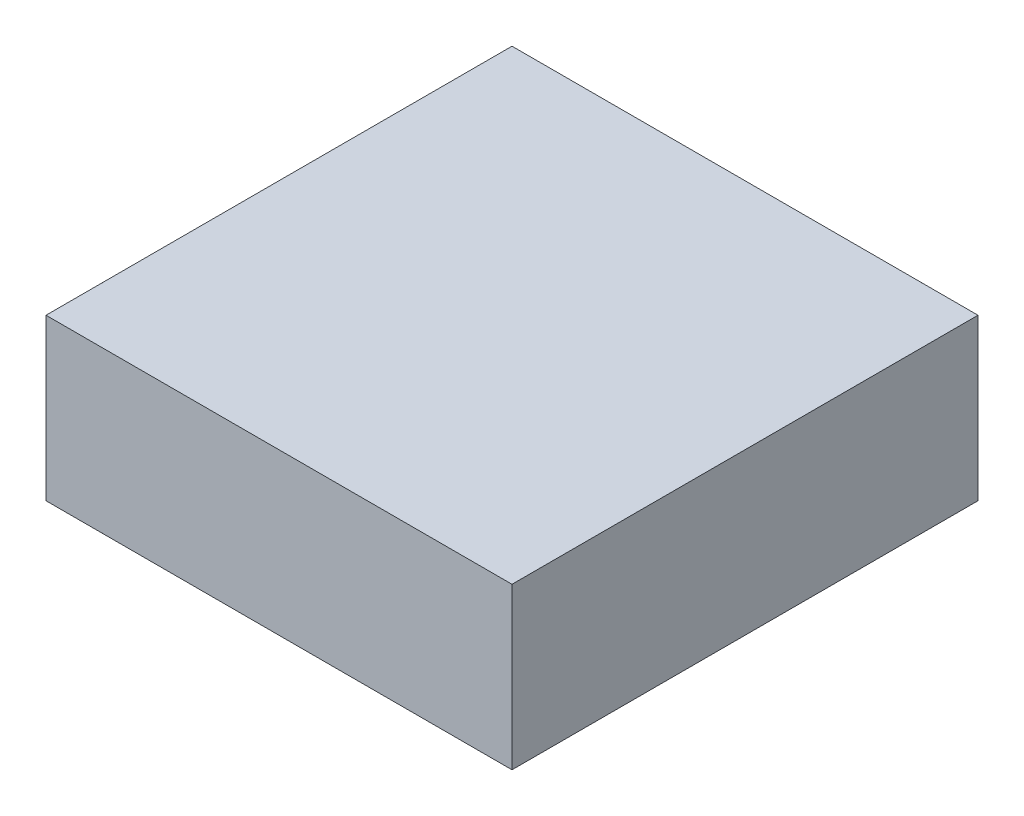
ISO-10303-21;
HEADER;
FILE_DESCRIPTION(('STEP AP214'),'2;1');
FILE_NAME('part.step','',(''),(''),'','','');
FILE_SCHEMA(('AUTOMOTIVE_DESIGN { 1 0 10303 214 1 1 1 1 }'));
ENDSEC;
DATA;
#1=APPLICATION_CONTEXT('core data for automotive mechanical design processes');
#2=APPLICATION_PROTOCOL_DEFINITION('international standard','automotive_design',2000,#1);
#3=PRODUCT_CONTEXT('',#1,'mechanical');
#4=PRODUCT('Part','Part','',(#3));
#5=PRODUCT_RELATED_PRODUCT_CATEGORY('part','',(#4));
#6=PRODUCT_DEFINITION_FORMATION('','',#4);
#7=PRODUCT_DEFINITION_CONTEXT('part definition',#1,'design');
#8=PRODUCT_DEFINITION('design','',#6,#7);
#9=PRODUCT_DEFINITION_SHAPE('','',#8);
#10=(LENGTH_UNIT() NAMED_UNIT(*) SI_UNIT(.MILLI.,.METRE.));
#11=(NAMED_UNIT(*) PLANE_ANGLE_UNIT() SI_UNIT($,.RADIAN.));
#12=(NAMED_UNIT(*) SI_UNIT($,.STERADIAN.) SOLID_ANGLE_UNIT());
#13=UNCERTAINTY_MEASURE_WITH_UNIT(LENGTH_MEASURE(1.E-05),#10,'distance_accuracy_value','');
#14=(GEOMETRIC_REPRESENTATION_CONTEXT(3) GLOBAL_UNCERTAINTY_ASSIGNED_CONTEXT((#13)) GLOBAL_UNIT_ASSIGNED_CONTEXT((#10,
#11,#12)) REPRESENTATION_CONTEXT('',''));
#15=CARTESIAN_POINT('',(0.,0.,0.));
#16=DIRECTION('',(0.,0.,1.));
#17=DIRECTION('',(1.,0.,0.));
#18=AXIS2_PLACEMENT_3D('',#15,#16,#17);
#19=CARTESIAN_POINT('',(-0.72499982,-0.2499995,0.));
#20=DIRECTION('',(0.,1.,0.));
#21=DIRECTION('',(0.,0.,1.));
#22=AXIS2_PLACEMENT_3D('',#19,#20,#21);
#23=PLANE('',#22);
#24=DIRECTION('',(0.,0.,1.));
#25=VECTOR('',#24,1.);
#26=CARTESIAN_POINT('',(0.72499982,-0.2499995,0.));
#27=LINE('',#26,#25);
#28=CARTESIAN_POINT('',(0.72499982,-0.2499995,0.));
#29=VERTEX_POINT('',#28);
#30=CARTESIAN_POINT('',(0.72499982,-0.2499995,1.44999964));
#31=VERTEX_POINT('',#30);
#32=EDGE_CURVE('E20',#29,#31,#27,.T.);
#33=ORIENTED_EDGE('',*,*,#32,.T.);
#34=DIRECTION('',(-1.,0.,0.));
#35=VECTOR('',#34,1.);
#36=CARTESIAN_POINT('',(0.72499982,-0.2499995,1.44999964));
#37=LINE('',#36,#35);
#38=CARTESIAN_POINT('',(-0.72499982,-0.2499995,1.44999964));
#39=VERTEX_POINT('',#38);
#40=EDGE_CURVE('E55',#31,#39,#37,.T.);
#41=ORIENTED_EDGE('',*,*,#40,.T.);
#42=DIRECTION('',(0.,0.,-1.));
#43=VECTOR('',#42,1.);
#44=CARTESIAN_POINT('',(-0.72499982,-0.2499995,0.));
#45=LINE('',#44,#43);
#46=CARTESIAN_POINT('',(-0.72499982,-0.2499995,0.));
#47=VERTEX_POINT('',#46);
#48=EDGE_CURVE('E76',#39,#47,#45,.T.);
#49=ORIENTED_EDGE('',*,*,#48,.T.);
#50=DIRECTION('',(-1.,0.,0.));
#51=VECTOR('',#50,1.);
#52=CARTESIAN_POINT('',(0.72499982,-0.2499995,0.));
#53=LINE('',#52,#51);
#54=EDGE_CURVE('E58',#29,#47,#53,.T.);
#55=ORIENTED_EDGE('',*,*,#54,.F.);
#56=EDGE_LOOP('',(#33,#41,#49,#55));
#57=FACE_BOUND('',#56,.T.);
#58=ADVANCED_FACE('F17',(#57),#23,.F.);
#59=CARTESIAN_POINT('',(0.72499982,-0.2499995,0.));
#60=DIRECTION('',(-1.,0.,0.));
#61=DIRECTION('',(0.,0.,1.));
#62=AXIS2_PLACEMENT_3D('',#59,#60,#61);
#63=PLANE('',#62);
#64=DIRECTION('',(0.,0.,-1.));
#65=VECTOR('',#64,1.);
#66=CARTESIAN_POINT('',(0.72499982,0.2499995,0.));
#67=LINE('',#66,#65);
#68=CARTESIAN_POINT('',(0.72499982,0.2499995,0.));
#69=VERTEX_POINT('',#68);
#70=CARTESIAN_POINT('',(0.72499982,0.2499995,1.44999964));
#71=VERTEX_POINT('',#70);
#72=EDGE_CURVE('E73',#69,#71,#67,.F.);
#73=ORIENTED_EDGE('',*,*,#72,.T.);
#74=DIRECTION('',(0.,1.,0.));
#75=VECTOR('',#74,1.);
#76=CARTESIAN_POINT('',(0.72499982,0.2499995,1.44999964));
#77=LINE('',#76,#75);
#78=EDGE_CURVE('E63',#71,#31,#77,.F.);
#79=ORIENTED_EDGE('',*,*,#78,.T.);
#80=ORIENTED_EDGE('',*,*,#32,.F.);
#81=DIRECTION('',(0.,1.,0.));
#82=VECTOR('',#81,1.);
#83=CARTESIAN_POINT('',(0.72499982,0.2499995,0.));
#84=LINE('',#83,#82);
#85=EDGE_CURVE('E78',#69,#29,#84,.F.);
#86=ORIENTED_EDGE('',*,*,#85,.F.);
#87=EDGE_LOOP('',(#73,#79,#80,#86));
#88=FACE_BOUND('',#87,.T.);
#89=ADVANCED_FACE('F72',(#88),#63,.F.);
#90=CARTESIAN_POINT('',(0.72499982,0.2499995,1.44999964));
#91=DIRECTION('',(0.,0.,-1.));
#92=DIRECTION('',(-1.,0.,0.));
#93=AXIS2_PLACEMENT_3D('',#90,#91,#92);
#94=PLANE('',#93);
#95=DIRECTION('',(0.,1.,0.));
#96=VECTOR('',#95,1.);
#97=CARTESIAN_POINT('',(-0.72499982,0.2499995,1.44999964));
#98=LINE('',#97,#96);
#99=CARTESIAN_POINT('',(-0.72499982,0.2499995,1.44999964));
#100=VERTEX_POINT('',#99);
#101=EDGE_CURVE('E69',#100,#39,#98,.F.);
#102=ORIENTED_EDGE('',*,*,#101,.T.);
#103=ORIENTED_EDGE('',*,*,#40,.F.);
#104=ORIENTED_EDGE('',*,*,#78,.F.);
#105=DIRECTION('',(1.,0.,0.));
#106=VECTOR('',#105,1.);
#107=CARTESIAN_POINT('',(0.72499982,0.2499995,1.44999964));
#108=LINE('',#107,#106);
#109=EDGE_CURVE('E83',#71,#100,#108,.F.);
#110=ORIENTED_EDGE('',*,*,#109,.T.);
#111=EDGE_LOOP('',(#102,#103,#104,#110));
#112=FACE_BOUND('',#111,.T.);
#113=ADVANCED_FACE('F66',(#112),#94,.F.);
#114=CARTESIAN_POINT('',(-0.72499982,0.2499995,0.));
#115=DIRECTION('',(1.,0.,0.));
#116=DIRECTION('',(0.,0.,-1.));
#117=AXIS2_PLACEMENT_3D('',#114,#115,#116);
#118=PLANE('',#117);
#119=ORIENTED_EDGE('',*,*,#48,.F.);
#120=ORIENTED_EDGE('',*,*,#101,.F.);
#121=DIRECTION('',(0.,0.,-1.));
#122=VECTOR('',#121,1.);
#123=CARTESIAN_POINT('',(-0.72499982,0.2499995,0.));
#124=LINE('',#123,#122);
#125=CARTESIAN_POINT('',(-0.72499982,0.2499995,0.));
#126=VERTEX_POINT('',#125);
#127=EDGE_CURVE('E26',#100,#126,#124,.T.);
#128=ORIENTED_EDGE('',*,*,#127,.T.);
#129=DIRECTION('',(0.,1.,0.));
#130=VECTOR('',#129,1.);
#131=CARTESIAN_POINT('',(-0.72499982,0.2499995,0.));
#132=LINE('',#131,#130);
#133=EDGE_CURVE('E34',#47,#126,#132,.T.);
#134=ORIENTED_EDGE('',*,*,#133,.F.);
#135=EDGE_LOOP('',(#119,#120,#128,#134));
#136=FACE_BOUND('',#135,.T.);
#137=ADVANCED_FACE('F88',(#136),#118,.F.);
#138=CARTESIAN_POINT('',(0.72499982,0.2499995,0.));
#139=DIRECTION('',(0.,0.,-1.));
#140=DIRECTION('',(-1.,0.,0.));
#141=AXIS2_PLACEMENT_3D('',#138,#139,#140);
#142=PLANE('',#141);
#143=ORIENTED_EDGE('',*,*,#133,.T.);
#144=DIRECTION('',(1.,0.,0.));
#145=VECTOR('',#144,1.);
#146=CARTESIAN_POINT('',(0.72499982,0.2499995,0.));
#147=LINE('',#146,#145);
#148=EDGE_CURVE('E11',#126,#69,#147,.T.);
#149=ORIENTED_EDGE('',*,*,#148,.T.);
#150=ORIENTED_EDGE('',*,*,#85,.T.);
#151=ORIENTED_EDGE('',*,*,#54,.T.);
#152=EDGE_LOOP('',(#143,#149,#150,#151));
#153=FACE_BOUND('',#152,.T.);
#154=ADVANCED_FACE('F91',(#153),#142,.T.);
#155=CARTESIAN_POINT('',(0.72499982,0.2499995,0.));
#156=DIRECTION('',(0.,-1.,0.));
#157=DIRECTION('',(0.,0.,-1.));
#158=AXIS2_PLACEMENT_3D('',#155,#156,#157);
#159=PLANE('',#158);
#160=ORIENTED_EDGE('',*,*,#127,.F.);
#161=ORIENTED_EDGE('',*,*,#109,.F.);
#162=ORIENTED_EDGE('',*,*,#72,.F.);
#163=ORIENTED_EDGE('',*,*,#148,.F.);
#164=EDGE_LOOP('',(#160,#161,#162,#163));
#165=FACE_BOUND('',#164,.T.);
#166=ADVANCED_FACE('F90',(#165),#159,.F.);
#167=CLOSED_SHELL('',(#58,#89,#113,#137,#154,#166));
#168=MANIFOLD_SOLID_BREP('B1',#167);
#169=ADVANCED_BREP_SHAPE_REPRESENTATION('',(#18,#168),#14);
#170=SHAPE_DEFINITION_REPRESENTATION(#9,#169);
ENDSEC;
END-ISO-10303-21;
